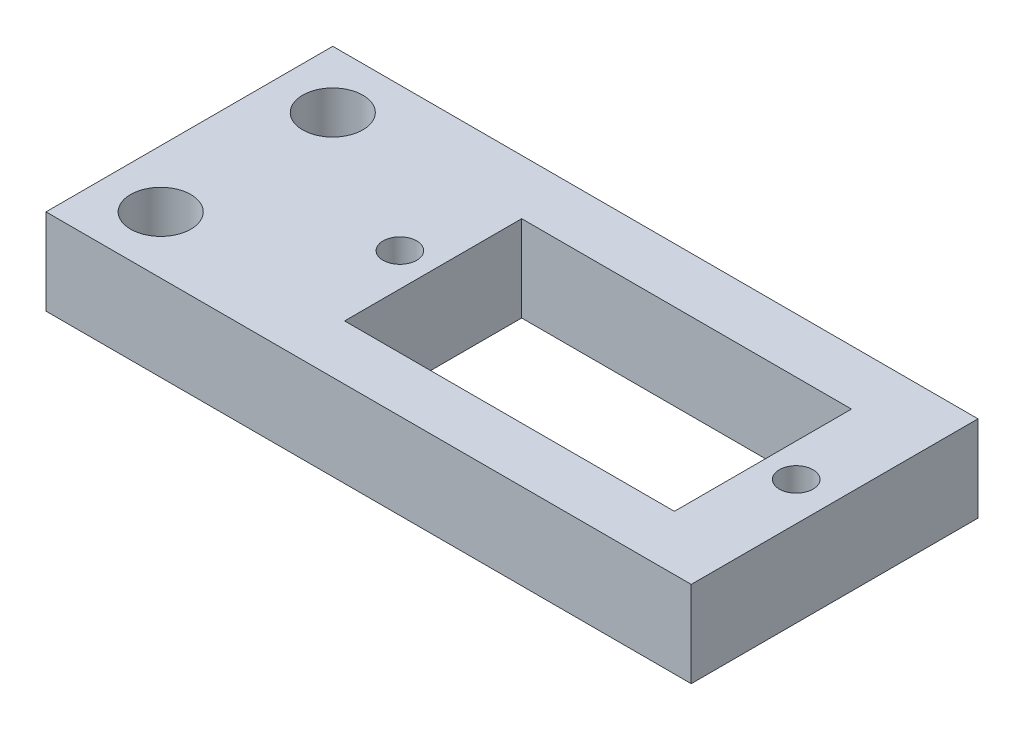
ISO-10303-21;
HEADER;
FILE_DESCRIPTION(('STEP AP214'),'2;1');
FILE_NAME('part.step','',(''),(''),'','','');
FILE_SCHEMA(('AUTOMOTIVE_DESIGN { 1 0 10303 214 1 1 1 1 }'));
ENDSEC;
DATA;
#1=APPLICATION_CONTEXT('core data for automotive mechanical design processes');
#2=APPLICATION_PROTOCOL_DEFINITION('international standard','automotive_design',2000,#1);
#3=PRODUCT_CONTEXT('',#1,'mechanical');
#4=PRODUCT('Part','Part','',(#3));
#5=PRODUCT_RELATED_PRODUCT_CATEGORY('part','',(#4));
#6=PRODUCT_DEFINITION_FORMATION('','',#4);
#7=PRODUCT_DEFINITION_CONTEXT('part definition',#1,'design');
#8=PRODUCT_DEFINITION('design','',#6,#7);
#9=PRODUCT_DEFINITION_SHAPE('','',#8);
#10=(LENGTH_UNIT() NAMED_UNIT(*) SI_UNIT(.MILLI.,.METRE.));
#11=(NAMED_UNIT(*) PLANE_ANGLE_UNIT() SI_UNIT($,.RADIAN.));
#12=(NAMED_UNIT(*) SI_UNIT($,.STERADIAN.) SOLID_ANGLE_UNIT());
#13=UNCERTAINTY_MEASURE_WITH_UNIT(LENGTH_MEASURE(1.E-05),#10,'distance_accuracy_value','');
#14=(GEOMETRIC_REPRESENTATION_CONTEXT(3) GLOBAL_UNCERTAINTY_ASSIGNED_CONTEXT((#13)) GLOBAL_UNIT_ASSIGNED_CONTEXT((#10,
#11,#12)) REPRESENTATION_CONTEXT('',''));
#15=CARTESIAN_POINT('',(0.,0.,0.));
#16=DIRECTION('',(0.,0.,1.));
#17=DIRECTION('',(1.,0.,0.));
#18=AXIS2_PLACEMENT_3D('',#15,#16,#17);
#19=CARTESIAN_POINT('',(22.5,6.,10.));
#20=DIRECTION('',(-1.,0.,0.));
#21=DIRECTION('',(0.,0.,1.));
#22=AXIS2_PLACEMENT_3D('',#19,#20,#21);
#23=PLANE('',#22);
#24=DIRECTION('',(0.,0.,-1.));
#25=VECTOR('',#24,1.);
#26=CARTESIAN_POINT('',(22.5,0.,10.));
#27=LINE('',#26,#25);
#28=CARTESIAN_POINT('',(22.5,0.,10.));
#29=VERTEX_POINT('',#28);
#30=CARTESIAN_POINT('',(22.5,0.,-10.));
#31=VERTEX_POINT('',#30);
#32=EDGE_CURVE('E141',#29,#31,#27,.T.);
#33=ORIENTED_EDGE('',*,*,#32,.T.);
#34=DIRECTION('',(0.,-1.,0.));
#35=VECTOR('',#34,1.);
#36=CARTESIAN_POINT('',(22.5,6.,-10.));
#37=LINE('',#36,#35);
#38=CARTESIAN_POINT('',(22.5,6.,-10.));
#39=VERTEX_POINT('',#38);
#40=EDGE_CURVE('E11',#39,#31,#37,.T.);
#41=ORIENTED_EDGE('',*,*,#40,.F.);
#42=DIRECTION('',(0.,0.,-1.));
#43=VECTOR('',#42,1.);
#44=CARTESIAN_POINT('',(22.5,6.,10.));
#45=LINE('',#44,#43);
#46=CARTESIAN_POINT('',(22.5,6.,10.));
#47=VERTEX_POINT('',#46);
#48=EDGE_CURVE('E150',#47,#39,#45,.T.);
#49=ORIENTED_EDGE('',*,*,#48,.F.);
#50=DIRECTION('',(0.,-1.,0.));
#51=VECTOR('',#50,1.);
#52=CARTESIAN_POINT('',(22.5,6.,10.));
#53=LINE('',#52,#51);
#54=EDGE_CURVE('E160',#47,#29,#53,.T.);
#55=ORIENTED_EDGE('',*,*,#54,.T.);
#56=EDGE_LOOP('',(#33,#41,#49,#55));
#57=FACE_BOUND('',#56,.T.);
#58=ADVANCED_FACE('F33',(#57),#23,.F.);
#59=CARTESIAN_POINT('',(-22.5,6.,-10.));
#60=DIRECTION('',(0.,0.,1.));
#61=DIRECTION('',(1.,0.,0.));
#62=AXIS2_PLACEMENT_3D('',#59,#60,#61);
#63=PLANE('',#62);
#64=DIRECTION('',(-1.,0.,0.));
#65=VECTOR('',#64,1.);
#66=CARTESIAN_POINT('',(-22.5,0.,-10.));
#67=LINE('',#66,#65);
#68=CARTESIAN_POINT('',(-22.5,0.,-10.));
#69=VERTEX_POINT('',#68);
#70=EDGE_CURVE('E163',#31,#69,#67,.T.);
#71=ORIENTED_EDGE('',*,*,#70,.T.);
#72=DIRECTION('',(0.,-1.,0.));
#73=VECTOR('',#72,1.);
#74=CARTESIAN_POINT('',(-22.5,6.,-10.));
#75=LINE('',#74,#73);
#76=CARTESIAN_POINT('',(-22.5,6.,-10.));
#77=VERTEX_POINT('',#76);
#78=EDGE_CURVE('E40',#77,#69,#75,.T.);
#79=ORIENTED_EDGE('',*,*,#78,.F.);
#80=DIRECTION('',(-1.,0.,0.));
#81=VECTOR('',#80,1.);
#82=CARTESIAN_POINT('',(-22.5,6.,-10.));
#83=LINE('',#82,#81);
#84=EDGE_CURVE('E153',#39,#77,#83,.T.);
#85=ORIENTED_EDGE('',*,*,#84,.F.);
#86=ORIENTED_EDGE('',*,*,#40,.T.);
#87=EDGE_LOOP('',(#71,#79,#85,#86));
#88=FACE_BOUND('',#87,.T.);
#89=ADVANCED_FACE('F192',(#88),#63,.F.);
#90=CARTESIAN_POINT('',(-22.5,6.,10.));
#91=DIRECTION('',(1.,0.,0.));
#92=DIRECTION('',(0.,0.,-1.));
#93=AXIS2_PLACEMENT_3D('',#90,#91,#92);
#94=PLANE('',#93);
#95=DIRECTION('',(0.,0.,1.));
#96=VECTOR('',#95,1.);
#97=CARTESIAN_POINT('',(-22.5,0.,10.));
#98=LINE('',#97,#96);
#99=CARTESIAN_POINT('',(-22.5,0.,10.));
#100=VERTEX_POINT('',#99);
#101=EDGE_CURVE('E165',#69,#100,#98,.T.);
#102=ORIENTED_EDGE('',*,*,#101,.T.);
#103=DIRECTION('',(0.,-1.,0.));
#104=VECTOR('',#103,1.);
#105=CARTESIAN_POINT('',(-22.5,6.,10.));
#106=LINE('',#105,#104);
#107=CARTESIAN_POINT('',(-22.5,6.,10.));
#108=VERTEX_POINT('',#107);
#109=EDGE_CURVE('E170',#108,#100,#106,.T.);
#110=ORIENTED_EDGE('',*,*,#109,.F.);
#111=DIRECTION('',(0.,0.,1.));
#112=VECTOR('',#111,1.);
#113=CARTESIAN_POINT('',(-22.5,6.,10.));
#114=LINE('',#113,#112);
#115=EDGE_CURVE('E156',#77,#108,#114,.T.);
#116=ORIENTED_EDGE('',*,*,#115,.F.);
#117=ORIENTED_EDGE('',*,*,#78,.T.);
#118=EDGE_LOOP('',(#102,#110,#116,#117));
#119=FACE_BOUND('',#118,.T.);
#120=ADVANCED_FACE('F177',(#119),#94,.F.);
#121=CARTESIAN_POINT('',(-22.5,6.,10.));
#122=DIRECTION('',(0.,0.,-1.));
#123=DIRECTION('',(-1.,0.,0.));
#124=AXIS2_PLACEMENT_3D('',#121,#122,#123);
#125=PLANE('',#124);
#126=DIRECTION('',(1.,0.,0.));
#127=VECTOR('',#126,1.);
#128=CARTESIAN_POINT('',(-22.5,0.,10.));
#129=LINE('',#128,#127);
#130=EDGE_CURVE('E154',#100,#29,#129,.T.);
#131=ORIENTED_EDGE('',*,*,#130,.T.);
#132=ORIENTED_EDGE('',*,*,#54,.F.);
#133=DIRECTION('',(1.,0.,0.));
#134=VECTOR('',#133,1.);
#135=CARTESIAN_POINT('',(-22.5,6.,10.));
#136=LINE('',#135,#134);
#137=EDGE_CURVE('E158',#108,#47,#136,.T.);
#138=ORIENTED_EDGE('',*,*,#137,.F.);
#139=ORIENTED_EDGE('',*,*,#109,.T.);
#140=EDGE_LOOP('',(#131,#132,#138,#139));
#141=FACE_BOUND('',#140,.T.);
#142=ADVANCED_FACE('F185',(#141),#125,.F.);
#143=CARTESIAN_POINT('',(0.,6.,0.));
#144=DIRECTION('',(0.,-1.,0.));
#145=DIRECTION('',(0.,0.,-1.));
#146=AXIS2_PLACEMENT_3D('',#143,#144,#145);
#147=PLANE('',#146);
#148=CARTESIAN_POINT('',(19.82,6.,0.));
#149=DIRECTION('',(0.,1.,0.));
#150=DIRECTION('',(0.,0.,-1.));
#151=AXIS2_PLACEMENT_3D('',#148,#149,#150);
#152=CIRCLE('',#151,1.175);
#153=CARTESIAN_POINT('',(19.82,6.,-1.175));
#154=VERTEX_POINT('',#153);
#155=EDGE_CURVE('E121',#154,#154,#152,.T.);
#156=ORIENTED_EDGE('',*,*,#155,.F.);
#157=EDGE_LOOP('',(#156));
#158=FACE_BOUND('',#157,.T.);
#159=CARTESIAN_POINT('',(-7.82,6.,0.));
#160=DIRECTION('',(0.,1.,0.));
#161=DIRECTION('',(0.,0.,1.));
#162=AXIS2_PLACEMENT_3D('',#159,#160,#161);
#163=CIRCLE('',#162,1.175);
#164=CARTESIAN_POINT('',(-7.82,6.,1.175));
#165=VERTEX_POINT('',#164);
#166=EDGE_CURVE('E241',#165,#165,#163,.T.);
#167=ORIENTED_EDGE('',*,*,#166,.F.);
#168=EDGE_LOOP('',(#167));
#169=FACE_BOUND('',#168,.T.);
#170=DIRECTION('',(1.,0.,0.));
#171=VECTOR('',#170,1.);
#172=CARTESIAN_POINT('',(-5.50000000000001,6.,6.175));
#173=LINE('',#172,#171);
#174=CARTESIAN_POINT('',(-5.50000000000001,6.,6.175));
#175=VERTEX_POINT('',#174);
#176=CARTESIAN_POINT('',(17.5,6.,6.175));
#177=VERTEX_POINT('',#176);
#178=EDGE_CURVE('E127',#175,#177,#173,.T.);
#179=ORIENTED_EDGE('',*,*,#178,.F.);
#180=DIRECTION('',(0.,0.,1.));
#181=VECTOR('',#180,1.);
#182=CARTESIAN_POINT('',(-5.50000000000001,6.,6.175));
#183=LINE('',#182,#181);
#184=CARTESIAN_POINT('',(-5.50000000000001,6.,-6.175));
#185=VERTEX_POINT('',#184);
#186=EDGE_CURVE('E47',#185,#175,#183,.T.);
#187=ORIENTED_EDGE('',*,*,#186,.F.);
#188=DIRECTION('',(-1.,0.,0.));
#189=VECTOR('',#188,1.);
#190=CARTESIAN_POINT('',(-5.50000000000001,6.,-6.175));
#191=LINE('',#190,#189);
#192=CARTESIAN_POINT('',(17.5,6.,-6.175));
#193=VERTEX_POINT('',#192);
#194=EDGE_CURVE('E115',#193,#185,#191,.T.);
#195=ORIENTED_EDGE('',*,*,#194,.F.);
#196=DIRECTION('',(0.,0.,-1.));
#197=VECTOR('',#196,1.);
#198=CARTESIAN_POINT('',(17.5,6.,6.175));
#199=LINE('',#198,#197);
#200=EDGE_CURVE('E118',#177,#193,#199,.T.);
#201=ORIENTED_EDGE('',*,*,#200,.F.);
#202=EDGE_LOOP('',(#179,#187,#195,#201));
#203=FACE_BOUND('',#202,.T.);
#204=CARTESIAN_POINT('',(-18.5,6.,6.));
#205=DIRECTION('',(0.,1.,0.));
#206=DIRECTION('',(0.,0.,1.));
#207=AXIS2_PLACEMENT_3D('',#204,#205,#206);
#208=CIRCLE('',#207,2.1);
#209=CARTESIAN_POINT('',(-18.5,6.,8.1));
#210=VERTEX_POINT('',#209);
#211=EDGE_CURVE('E142',#210,#210,#208,.T.);
#212=ORIENTED_EDGE('',*,*,#211,.F.);
#213=EDGE_LOOP('',(#212));
#214=FACE_BOUND('',#213,.T.);
#215=CARTESIAN_POINT('',(-18.5,6.,-6.));
#216=DIRECTION('',(0.,1.,0.));
#217=DIRECTION('',(0.,0.,1.));
#218=AXIS2_PLACEMENT_3D('',#215,#216,#217);
#219=CIRCLE('',#218,2.1);
#220=CARTESIAN_POINT('',(-18.5,6.,-3.9));
#221=VERTEX_POINT('',#220);
#222=EDGE_CURVE('E134',#221,#221,#219,.T.);
#223=ORIENTED_EDGE('',*,*,#222,.F.);
#224=EDGE_LOOP('',(#223));
#225=FACE_BOUND('',#224,.T.);
#226=ORIENTED_EDGE('',*,*,#48,.T.);
#227=ORIENTED_EDGE('',*,*,#84,.T.);
#228=ORIENTED_EDGE('',*,*,#115,.T.);
#229=ORIENTED_EDGE('',*,*,#137,.T.);
#230=EDGE_LOOP('',(#226,#227,#228,#229));
#231=FACE_BOUND('',#230,.T.);
#232=ADVANCED_FACE('F191',(#158,#169,#203,#214,#225,#231),#147,.F.);
#233=CARTESIAN_POINT('',(0.,0.,0.));
#234=DIRECTION('',(0.,-1.,0.));
#235=DIRECTION('',(0.,0.,-1.));
#236=AXIS2_PLACEMENT_3D('',#233,#234,#235);
#237=PLANE('',#236);
#238=CARTESIAN_POINT('',(19.82,0.,0.));
#239=DIRECTION('',(0.,1.,0.));
#240=DIRECTION('',(0.,0.,-1.));
#241=AXIS2_PLACEMENT_3D('',#238,#239,#240);
#242=CIRCLE('',#241,1.175);
#243=CARTESIAN_POINT('',(19.82,0.,-1.175));
#244=VERTEX_POINT('',#243);
#245=EDGE_CURVE('E243',#244,#244,#242,.T.);
#246=ORIENTED_EDGE('',*,*,#245,.T.);
#247=EDGE_LOOP('',(#246));
#248=FACE_BOUND('',#247,.T.);
#249=CARTESIAN_POINT('',(-7.82,0.,0.));
#250=DIRECTION('',(0.,1.,0.));
#251=DIRECTION('',(0.,0.,1.));
#252=AXIS2_PLACEMENT_3D('',#249,#250,#251);
#253=CIRCLE('',#252,1.175);
#254=CARTESIAN_POINT('',(-7.82,0.,1.175));
#255=VERTEX_POINT('',#254);
#256=EDGE_CURVE('E128',#255,#255,#253,.T.);
#257=ORIENTED_EDGE('',*,*,#256,.T.);
#258=EDGE_LOOP('',(#257));
#259=FACE_BOUND('',#258,.T.);
#260=DIRECTION('',(0.,0.,1.));
#261=VECTOR('',#260,1.);
#262=CARTESIAN_POINT('',(-5.50000000000001,0.,6.175));
#263=LINE('',#262,#261);
#264=CARTESIAN_POINT('',(-5.50000000000001,0.,-6.175));
#265=VERTEX_POINT('',#264);
#266=CARTESIAN_POINT('',(-5.50000000000001,0.,6.175));
#267=VERTEX_POINT('',#266);
#268=EDGE_CURVE('E99',#265,#267,#263,.T.);
#269=ORIENTED_EDGE('',*,*,#268,.T.);
#270=DIRECTION('',(1.,0.,0.));
#271=VECTOR('',#270,1.);
#272=CARTESIAN_POINT('',(-5.50000000000001,0.,6.175));
#273=LINE('',#272,#271);
#274=CARTESIAN_POINT('',(17.5,0.,6.175));
#275=VERTEX_POINT('',#274);
#276=EDGE_CURVE('E108',#267,#275,#273,.T.);
#277=ORIENTED_EDGE('',*,*,#276,.T.);
#278=DIRECTION('',(0.,0.,-1.));
#279=VECTOR('',#278,1.);
#280=CARTESIAN_POINT('',(17.5,0.,6.175));
#281=LINE('',#280,#279);
#282=CARTESIAN_POINT('',(17.5,0.,-6.175));
#283=VERTEX_POINT('',#282);
#284=EDGE_CURVE('E55',#275,#283,#281,.T.);
#285=ORIENTED_EDGE('',*,*,#284,.T.);
#286=DIRECTION('',(-1.,0.,0.));
#287=VECTOR('',#286,1.);
#288=CARTESIAN_POINT('',(-5.50000000000001,0.,-6.175));
#289=LINE('',#288,#287);
#290=EDGE_CURVE('E105',#283,#265,#289,.T.);
#291=ORIENTED_EDGE('',*,*,#290,.T.);
#292=EDGE_LOOP('',(#269,#277,#285,#291));
#293=FACE_BOUND('',#292,.T.);
#294=CARTESIAN_POINT('',(-18.5,0.,6.));
#295=DIRECTION('',(0.,1.,0.));
#296=DIRECTION('',(0.,0.,1.));
#297=AXIS2_PLACEMENT_3D('',#294,#295,#296);
#298=CIRCLE('',#297,2.1);
#299=CARTESIAN_POINT('',(-18.5,0.,8.1));
#300=VERTEX_POINT('',#299);
#301=EDGE_CURVE('E138',#300,#300,#298,.T.);
#302=ORIENTED_EDGE('',*,*,#301,.T.);
#303=EDGE_LOOP('',(#302));
#304=FACE_BOUND('',#303,.T.);
#305=CARTESIAN_POINT('',(-18.5,0.,-6.));
#306=DIRECTION('',(0.,1.,0.));
#307=DIRECTION('',(0.,0.,1.));
#308=AXIS2_PLACEMENT_3D('',#305,#306,#307);
#309=CIRCLE('',#308,2.1);
#310=CARTESIAN_POINT('',(-18.5,0.,-3.9));
#311=VERTEX_POINT('',#310);
#312=EDGE_CURVE('E145',#311,#311,#309,.T.);
#313=ORIENTED_EDGE('',*,*,#312,.T.);
#314=EDGE_LOOP('',(#313));
#315=FACE_BOUND('',#314,.T.);
#316=ORIENTED_EDGE('',*,*,#32,.F.);
#317=ORIENTED_EDGE('',*,*,#130,.F.);
#318=ORIENTED_EDGE('',*,*,#101,.F.);
#319=ORIENTED_EDGE('',*,*,#70,.F.);
#320=EDGE_LOOP('',(#316,#317,#318,#319));
#321=FACE_BOUND('',#320,.T.);
#322=ADVANCED_FACE('F112',(#248,#259,#293,#304,#315,#321),#237,.T.);
#323=CARTESIAN_POINT('',(-18.5,0.,-6.));
#324=DIRECTION('',(0.,1.,0.));
#325=DIRECTION('',(0.,0.,1.));
#326=AXIS2_PLACEMENT_3D('',#323,#324,#325);
#327=CYLINDRICAL_SURFACE('',#326,2.1);
#328=ORIENTED_EDGE('',*,*,#312,.F.);
#329=EDGE_LOOP('',(#328));
#330=FACE_BOUND('',#329,.T.);
#331=ORIENTED_EDGE('',*,*,#222,.T.);
#332=EDGE_LOOP('',(#331));
#333=FACE_BOUND('',#332,.T.);
#334=ADVANCED_FACE('F204',(#330,#333),#327,.F.);
#335=CARTESIAN_POINT('',(-18.5,0.,6.));
#336=DIRECTION('',(0.,1.,0.));
#337=DIRECTION('',(0.,0.,1.));
#338=AXIS2_PLACEMENT_3D('',#335,#336,#337);
#339=CYLINDRICAL_SURFACE('',#338,2.1);
#340=ORIENTED_EDGE('',*,*,#301,.F.);
#341=EDGE_LOOP('',(#340));
#342=FACE_BOUND('',#341,.T.);
#343=ORIENTED_EDGE('',*,*,#211,.T.);
#344=EDGE_LOOP('',(#343));
#345=FACE_BOUND('',#344,.T.);
#346=ADVANCED_FACE('F211',(#342,#345),#339,.F.);
#347=CARTESIAN_POINT('',(-5.50000000000001,0.,6.175));
#348=DIRECTION('',(-1.,0.,0.));
#349=DIRECTION('',(0.,0.,1.));
#350=AXIS2_PLACEMENT_3D('',#347,#348,#349);
#351=PLANE('',#350);
#352=ORIENTED_EDGE('',*,*,#186,.T.);
#353=DIRECTION('',(0.,1.,0.));
#354=VECTOR('',#353,1.);
#355=CARTESIAN_POINT('',(-5.50000000000001,0.,6.175));
#356=LINE('',#355,#354);
#357=EDGE_CURVE('E95',#267,#175,#356,.T.);
#358=ORIENTED_EDGE('',*,*,#357,.F.);
#359=ORIENTED_EDGE('',*,*,#268,.F.);
#360=DIRECTION('',(0.,1.,0.));
#361=VECTOR('',#360,1.);
#362=CARTESIAN_POINT('',(-5.50000000000001,0.,-6.175));
#363=LINE('',#362,#361);
#364=EDGE_CURVE('E132',#265,#185,#363,.T.);
#365=ORIENTED_EDGE('',*,*,#364,.T.);
#366=EDGE_LOOP('',(#352,#358,#359,#365));
#367=FACE_BOUND('',#366,.T.);
#368=ADVANCED_FACE('F97',(#367),#351,.F.);
#369=CARTESIAN_POINT('',(-5.50000000000001,0.,-6.175));
#370=DIRECTION('',(0.,0.,-1.));
#371=DIRECTION('',(-1.,0.,0.));
#372=AXIS2_PLACEMENT_3D('',#369,#370,#371);
#373=PLANE('',#372);
#374=ORIENTED_EDGE('',*,*,#194,.T.);
#375=ORIENTED_EDGE('',*,*,#364,.F.);
#376=ORIENTED_EDGE('',*,*,#290,.F.);
#377=DIRECTION('',(0.,1.,0.));
#378=VECTOR('',#377,1.);
#379=CARTESIAN_POINT('',(17.5,0.,-6.175));
#380=LINE('',#379,#378);
#381=EDGE_CURVE('E135',#283,#193,#380,.T.);
#382=ORIENTED_EDGE('',*,*,#381,.T.);
#383=EDGE_LOOP('',(#374,#375,#376,#382));
#384=FACE_BOUND('',#383,.T.);
#385=ADVANCED_FACE('F218',(#384),#373,.F.);
#386=CARTESIAN_POINT('',(17.5,0.,6.175));
#387=DIRECTION('',(1.,0.,0.));
#388=DIRECTION('',(0.,0.,-1.));
#389=AXIS2_PLACEMENT_3D('',#386,#387,#388);
#390=PLANE('',#389);
#391=ORIENTED_EDGE('',*,*,#200,.T.);
#392=ORIENTED_EDGE('',*,*,#381,.F.);
#393=ORIENTED_EDGE('',*,*,#284,.F.);
#394=DIRECTION('',(0.,1.,0.));
#395=VECTOR('',#394,1.);
#396=CARTESIAN_POINT('',(17.5,0.,6.175));
#397=LINE('',#396,#395);
#398=EDGE_CURVE('E104',#275,#177,#397,.T.);
#399=ORIENTED_EDGE('',*,*,#398,.T.);
#400=EDGE_LOOP('',(#391,#392,#393,#399));
#401=FACE_BOUND('',#400,.T.);
#402=ADVANCED_FACE('F222',(#401),#390,.F.);
#403=CARTESIAN_POINT('',(-5.50000000000001,0.,6.175));
#404=DIRECTION('',(0.,0.,1.));
#405=DIRECTION('',(1.,0.,0.));
#406=AXIS2_PLACEMENT_3D('',#403,#404,#405);
#407=PLANE('',#406);
#408=ORIENTED_EDGE('',*,*,#178,.T.);
#409=ORIENTED_EDGE('',*,*,#398,.F.);
#410=ORIENTED_EDGE('',*,*,#276,.F.);
#411=ORIENTED_EDGE('',*,*,#357,.T.);
#412=EDGE_LOOP('',(#408,#409,#410,#411));
#413=FACE_BOUND('',#412,.T.);
#414=ADVANCED_FACE('F109',(#413),#407,.F.);
#415=CARTESIAN_POINT('',(-7.82,0.,0.));
#416=DIRECTION('',(0.,1.,0.));
#417=DIRECTION('',(0.,0.,1.));
#418=AXIS2_PLACEMENT_3D('',#415,#416,#417);
#419=CYLINDRICAL_SURFACE('',#418,1.175);
#420=ORIENTED_EDGE('',*,*,#256,.F.);
#421=EDGE_LOOP('',(#420));
#422=FACE_BOUND('',#421,.T.);
#423=ORIENTED_EDGE('',*,*,#166,.T.);
#424=EDGE_LOOP('',(#423));
#425=FACE_BOUND('',#424,.T.);
#426=ADVANCED_FACE('F221',(#422,#425),#419,.F.);
#427=CARTESIAN_POINT('',(19.82,0.,0.));
#428=DIRECTION('',(0.,1.,0.));
#429=DIRECTION('',(0.,0.,1.));
#430=AXIS2_PLACEMENT_3D('',#427,#428,#429);
#431=CYLINDRICAL_SURFACE('',#430,1.175);
#432=ORIENTED_EDGE('',*,*,#245,.F.);
#433=EDGE_LOOP('',(#432));
#434=FACE_BOUND('',#433,.T.);
#435=ORIENTED_EDGE('',*,*,#155,.T.);
#436=EDGE_LOOP('',(#435));
#437=FACE_BOUND('',#436,.T.);
#438=ADVANCED_FACE('F228',(#434,#437),#431,.F.);
#439=CLOSED_SHELL('',(#58,#89,#120,#142,#232,#322,#334,#346,#368,#385,#402,#414,#426,#438));
#440=MANIFOLD_SOLID_BREP('B2',#439);
#441=ADVANCED_BREP_SHAPE_REPRESENTATION('',(#18,#440),#14);
#442=SHAPE_DEFINITION_REPRESENTATION(#9,#441);
ENDSEC;
END-ISO-10303-21;
